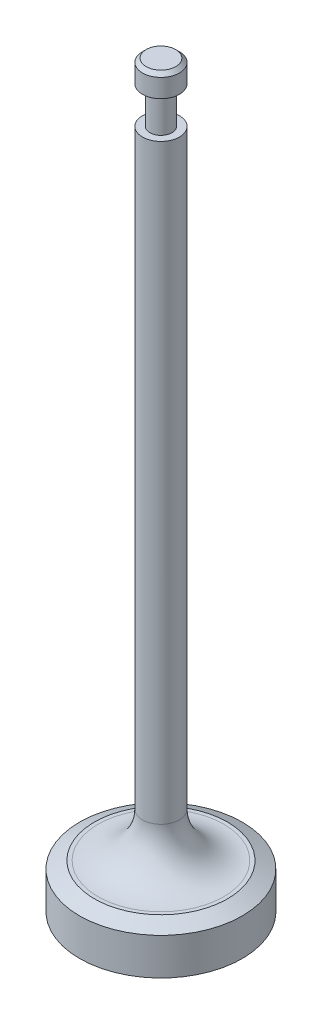
ISO-10303-21;
HEADER;
FILE_DESCRIPTION(('STEP AP214'),'2;1');
FILE_NAME('part.step','',(''),(''),'','','');
FILE_SCHEMA(('AUTOMOTIVE_DESIGN { 1 0 10303 214 1 1 1 1 }'));
ENDSEC;
DATA;
#1=APPLICATION_CONTEXT('core data for automotive mechanical design processes');
#2=APPLICATION_PROTOCOL_DEFINITION('international standard','automotive_design',2000,#1);
#3=PRODUCT_CONTEXT('',#1,'mechanical');
#4=PRODUCT('Part','Part','',(#3));
#5=PRODUCT_RELATED_PRODUCT_CATEGORY('part','',(#4));
#6=PRODUCT_DEFINITION_FORMATION('','',#4);
#7=PRODUCT_DEFINITION_CONTEXT('part definition',#1,'design');
#8=PRODUCT_DEFINITION('design','',#6,#7);
#9=PRODUCT_DEFINITION_SHAPE('','',#8);
#10=(LENGTH_UNIT() NAMED_UNIT(*) SI_UNIT(.MILLI.,.METRE.));
#11=(NAMED_UNIT(*) PLANE_ANGLE_UNIT() SI_UNIT($,.RADIAN.));
#12=(NAMED_UNIT(*) SI_UNIT($,.STERADIAN.) SOLID_ANGLE_UNIT());
#13=UNCERTAINTY_MEASURE_WITH_UNIT(LENGTH_MEASURE(1.E-05),#10,'distance_accuracy_value','');
#14=(GEOMETRIC_REPRESENTATION_CONTEXT(3) GLOBAL_UNCERTAINTY_ASSIGNED_CONTEXT((#13)) GLOBAL_UNIT_ASSIGNED_CONTEXT((#10,
#11,#12)) REPRESENTATION_CONTEXT('',''));
#15=CARTESIAN_POINT('',(0.,0.,0.));
#16=DIRECTION('',(0.,0.,1.));
#17=DIRECTION('',(1.,0.,0.));
#18=AXIS2_PLACEMENT_3D('',#15,#16,#17);
#19=CARTESIAN_POINT('',(0.,0.,-2.50000000000002));
#20=DIRECTION('',(0.,-1.,0.));
#21=DIRECTION('',(0.,0.,-1.));
#22=AXIS2_PLACEMENT_3D('',#19,#20,#21);
#23=PLANE('',#22);
#24=CARTESIAN_POINT('',(0.,0.,0.));
#25=DIRECTION('',(0.,-1.,0.));
#26=DIRECTION('',(0.,0.,-1.));
#27=AXIS2_PLACEMENT_3D('',#24,#25,#26);
#28=CIRCLE('',#27,2.00000000000002);
#29=CARTESIAN_POINT('',(0.,0.,-2.00000000000002));
#30=VERTEX_POINT('',#29);
#31=EDGE_CURVE('E45',#30,#30,#28,.F.);
#32=ORIENTED_EDGE('',*,*,#31,.T.);
#33=EDGE_LOOP('',(#32));
#34=FACE_BOUND('',#33,.T.);
#35=ADVANCED_FACE('F37',(#34),#23,.F.);
#36=CARTESIAN_POINT('',(0.,-100.,0.));
#37=DIRECTION('',(0.,1.,0.));
#38=DIRECTION('',(0.,0.,1.));
#39=AXIS2_PLACEMENT_3D('',#36,#37,#38);
#40=PLANE('',#39);
#41=CARTESIAN_POINT('',(0.,-100.,0.));
#42=DIRECTION('',(0.,1.,0.));
#43=DIRECTION('',(0.,0.,1.));
#44=AXIS2_PLACEMENT_3D('',#41,#42,#43);
#45=CIRCLE('',#44,11.);
#46=CARTESIAN_POINT('',(0.,-100.,11.));
#47=VERTEX_POINT('',#46);
#48=EDGE_CURVE('E64',#47,#47,#45,.T.);
#49=ORIENTED_EDGE('',*,*,#48,.F.);
#50=EDGE_LOOP('',(#49));
#51=FACE_BOUND('',#50,.T.);
#52=ADVANCED_FACE('F112',(#51),#40,.F.);
#53=CARTESIAN_POINT('',(0.,0.,0.));
#54=DIRECTION('',(0.,1.,0.));
#55=DIRECTION('',(0.,0.,1.));
#56=AXIS2_PLACEMENT_3D('',#53,#54,#55);
#57=CYLINDRICAL_SURFACE('',#56,11.);
#58=CARTESIAN_POINT('',(0.,-95.,0.));
#59=DIRECTION('',(0.,-1.,0.));
#60=DIRECTION('',(0.,0.,-1.));
#61=AXIS2_PLACEMENT_3D('',#58,#59,#60);
#62=CIRCLE('',#61,11.);
#63=CARTESIAN_POINT('',(0.,-95.,-11.));
#64=VERTEX_POINT('',#63);
#65=EDGE_CURVE('E49',#64,#64,#62,.T.);
#66=ORIENTED_EDGE('',*,*,#65,.T.);
#67=EDGE_LOOP('',(#66));
#68=FACE_BOUND('',#67,.T.);
#69=ORIENTED_EDGE('',*,*,#48,.T.);
#70=EDGE_LOOP('',(#69));
#71=FACE_BOUND('',#70,.T.);
#72=ADVANCED_FACE('F108',(#68,#71),#57,.T.);
#73=CARTESIAN_POINT('',(0.,-94.,-11.));
#74=DIRECTION('',(0.,-1.,0.));
#75=DIRECTION('',(0.,0.,-1.));
#76=AXIS2_PLACEMENT_3D('',#73,#74,#75);
#77=PLANE('',#76);
#78=CARTESIAN_POINT('',(0.,-94.,0.));
#79=DIRECTION('',(0.,-1.,0.));
#80=DIRECTION('',(0.,0.,-1.));
#81=AXIS2_PLACEMENT_3D('',#78,#79,#80);
#82=CIRCLE('',#81,9.);
#83=CARTESIAN_POINT('',(0.,-94.,-9.00000000000001));
#84=VERTEX_POINT('',#83);
#85=EDGE_CURVE('E53',#84,#84,#82,.F.);
#86=ORIENTED_EDGE('',*,*,#85,.T.);
#87=EDGE_LOOP('',(#86));
#88=FACE_BOUND('',#87,.T.);
#89=CARTESIAN_POINT('',(0.,-94.,0.));
#90=DIRECTION('',(0.,-1.,0.));
#91=DIRECTION('',(0.,0.,-1.));
#92=AXIS2_PLACEMENT_3D('',#89,#90,#91);
#93=CIRCLE('',#92,8.5);
#94=CARTESIAN_POINT('',(0.,-94.,-8.50000000000002));
#95=VERTEX_POINT('',#94);
#96=EDGE_CURVE('E58',#95,#95,#93,.T.);
#97=ORIENTED_EDGE('',*,*,#96,.T.);
#98=EDGE_LOOP('',(#97));
#99=FACE_BOUND('',#98,.T.);
#100=ADVANCED_FACE('F102',(#88,#99),#77,.F.);
#101=CARTESIAN_POINT('',(0.,0.,0.));
#102=DIRECTION('',(0.,1.,0.));
#103=DIRECTION('',(0.,0.,1.));
#104=AXIS2_PLACEMENT_3D('',#101,#102,#103);
#105=CYLINDRICAL_SURFACE('',#104,2.5);
#106=CARTESIAN_POINT('',(0.,-88.,0.));
#107=DIRECTION('',(0.,-1.,0.));
#108=DIRECTION('',(0.,0.,-1.));
#109=AXIS2_PLACEMENT_3D('',#106,#107,#108);
#110=CIRCLE('',#109,2.5);
#111=CARTESIAN_POINT('',(0.,-88.,-2.50000000000001));
#112=VERTEX_POINT('',#111);
#113=EDGE_CURVE('E61',#112,#112,#110,.F.);
#114=ORIENTED_EDGE('',*,*,#113,.T.);
#115=EDGE_LOOP('',(#114));
#116=FACE_BOUND('',#115,.T.);
#117=CARTESIAN_POINT('',(0.,-8.,0.));
#118=DIRECTION('',(0.,1.,0.));
#119=DIRECTION('',(0.,0.,1.));
#120=AXIS2_PLACEMENT_3D('',#117,#118,#119);
#121=CIRCLE('',#120,2.50000000000001);
#122=CARTESIAN_POINT('',(0.,-8.,2.50000000000001));
#123=VERTEX_POINT('',#122);
#124=EDGE_CURVE('E67',#123,#123,#121,.T.);
#125=ORIENTED_EDGE('',*,*,#124,.F.);
#126=EDGE_LOOP('',(#125));
#127=FACE_BOUND('',#126,.T.);
#128=ADVANCED_FACE('F97',(#116,#127),#105,.T.);
#129=CARTESIAN_POINT('',(0.,-8.,-2.50000000000001));
#130=DIRECTION('',(0.,-1.,0.));
#131=DIRECTION('',(0.,0.,-1.));
#132=AXIS2_PLACEMENT_3D('',#129,#130,#131);
#133=PLANE('',#132);
#134=CARTESIAN_POINT('',(0.,-8.,0.));
#135=DIRECTION('',(0.,1.,0.));
#136=DIRECTION('',(0.,0.,1.));
#137=AXIS2_PLACEMENT_3D('',#134,#135,#136);
#138=CIRCLE('',#137,1.50000000000002);
#139=CARTESIAN_POINT('',(0.,-8.,1.50000000000002));
#140=VERTEX_POINT('',#139);
#141=EDGE_CURVE('E70',#140,#140,#138,.T.);
#142=ORIENTED_EDGE('',*,*,#141,.F.);
#143=EDGE_LOOP('',(#142));
#144=FACE_BOUND('',#143,.T.);
#145=ORIENTED_EDGE('',*,*,#124,.T.);
#146=EDGE_LOOP('',(#145));
#147=FACE_BOUND('',#146,.T.);
#148=ADVANCED_FACE('F91',(#144,#147),#133,.F.);
#149=CARTESIAN_POINT('',(0.,0.,0.));
#150=DIRECTION('',(0.,1.,0.));
#151=DIRECTION('',(0.,0.,1.));
#152=AXIS2_PLACEMENT_3D('',#149,#150,#151);
#153=CYLINDRICAL_SURFACE('',#152,1.50000000000002);
#154=CARTESIAN_POINT('',(0.,-3.,0.));
#155=DIRECTION('',(0.,1.,0.));
#156=DIRECTION('',(0.,0.,1.));
#157=AXIS2_PLACEMENT_3D('',#154,#155,#156);
#158=CIRCLE('',#157,1.50000000000002);
#159=CARTESIAN_POINT('',(0.,-3.,1.50000000000002));
#160=VERTEX_POINT('',#159);
#161=EDGE_CURVE('E73',#160,#160,#158,.T.);
#162=ORIENTED_EDGE('',*,*,#161,.F.);
#163=EDGE_LOOP('',(#162));
#164=FACE_BOUND('',#163,.T.);
#165=ORIENTED_EDGE('',*,*,#141,.T.);
#166=EDGE_LOOP('',(#165));
#167=FACE_BOUND('',#166,.T.);
#168=ADVANCED_FACE('F85',(#164,#167),#153,.T.);
#169=CARTESIAN_POINT('',(0.,-3.,-1.50000000000002));
#170=DIRECTION('',(0.,1.,0.));
#171=DIRECTION('',(0.,0.,1.));
#172=AXIS2_PLACEMENT_3D('',#169,#170,#171);
#173=PLANE('',#172);
#174=CARTESIAN_POINT('',(0.,-3.,0.));
#175=DIRECTION('',(0.,1.,0.));
#176=DIRECTION('',(0.,0.,1.));
#177=AXIS2_PLACEMENT_3D('',#174,#175,#176);
#178=CIRCLE('',#177,2.50000000000002);
#179=CARTESIAN_POINT('',(0.,-3.,2.50000000000002));
#180=VERTEX_POINT('',#179);
#181=EDGE_CURVE('E76',#180,#180,#178,.T.);
#182=ORIENTED_EDGE('',*,*,#181,.F.);
#183=EDGE_LOOP('',(#182));
#184=FACE_BOUND('',#183,.T.);
#185=ORIENTED_EDGE('',*,*,#161,.T.);
#186=EDGE_LOOP('',(#185));
#187=FACE_BOUND('',#186,.T.);
#188=ADVANCED_FACE('F82',(#184,#187),#173,.F.);
#189=CARTESIAN_POINT('',(0.,0.,0.));
#190=DIRECTION('',(0.,1.,0.));
#191=DIRECTION('',(0.,0.,1.));
#192=AXIS2_PLACEMENT_3D('',#189,#190,#191);
#193=CYLINDRICAL_SURFACE('',#192,2.50000000000002);
#194=CARTESIAN_POINT('',(0.,-0.500000000000002,0.));
#195=DIRECTION('',(0.,-1.,0.));
#196=DIRECTION('',(0.,0.,-1.));
#197=AXIS2_PLACEMENT_3D('',#194,#195,#196);
#198=CIRCLE('',#197,2.50000000000002);
#199=CARTESIAN_POINT('',(0.,-0.500000000000002,-2.50000000000002));
#200=VERTEX_POINT('',#199);
#201=EDGE_CURVE('E10',#200,#200,#198,.T.);
#202=ORIENTED_EDGE('',*,*,#201,.T.);
#203=EDGE_LOOP('',(#202));
#204=FACE_BOUND('',#203,.T.);
#205=ORIENTED_EDGE('',*,*,#181,.T.);
#206=EDGE_LOOP('',(#205));
#207=FACE_BOUND('',#206,.T.);
#208=ADVANCED_FACE('F80',(#204,#207),#193,.T.);
#209=CARTESIAN_POINT('',(0.,-88.,0.));
#210=DIRECTION('',(0.,-1.,0.));
#211=DIRECTION('',(0.,0.,-1.));
#212=AXIS2_PLACEMENT_3D('',#209,#210,#211);
#213=TOROIDAL_SURFACE('',#212,8.5,6.);
#214=ORIENTED_EDGE('',*,*,#96,.F.);
#215=EDGE_LOOP('',(#214));
#216=FACE_BOUND('',#215,.T.);
#217=ORIENTED_EDGE('',*,*,#113,.F.);
#218=EDGE_LOOP('',(#217));
#219=FACE_BOUND('',#218,.T.);
#220=ADVANCED_FACE('F121',(#216,#219),#213,.F.);
#221=CARTESIAN_POINT('',(0.,-94.,0.));
#222=DIRECTION('',(0.,-1.,0.));
#223=DIRECTION('',(0.,0.,-1.));
#224=AXIS2_PLACEMENT_3D('',#221,#222,#223);
#225=CONICAL_SURFACE('',#224,8.99999999999999,1.1071487177941);
#226=ORIENTED_EDGE('',*,*,#65,.F.);
#227=EDGE_LOOP('',(#226));
#228=FACE_BOUND('',#227,.T.);
#229=ORIENTED_EDGE('',*,*,#85,.F.);
#230=EDGE_LOOP('',(#229));
#231=FACE_BOUND('',#230,.T.);
#232=ADVANCED_FACE('F123',(#228,#231),#225,.T.);
#233=CARTESIAN_POINT('',(0.,0.,0.));
#234=DIRECTION('',(0.,-1.,0.));
#235=DIRECTION('',(0.,0.,-1.));
#236=AXIS2_PLACEMENT_3D('',#233,#234,#235);
#237=CONICAL_SURFACE('',#236,2.00000000000002,0.785398163397453);
#238=ORIENTED_EDGE('',*,*,#201,.F.);
#239=EDGE_LOOP('',(#238));
#240=FACE_BOUND('',#239,.T.);
#241=ORIENTED_EDGE('',*,*,#31,.F.);
#242=EDGE_LOOP('',(#241));
#243=FACE_BOUND('',#242,.T.);
#244=ADVANCED_FACE('F40',(#240,#243),#237,.T.);
#245=CLOSED_SHELL('',(#35,#52,#72,#100,#128,#148,#168,#188,#208,#220,#232,#244));
#246=MANIFOLD_SOLID_BREP('B2',#245);
#247=ADVANCED_BREP_SHAPE_REPRESENTATION('',(#18,#246),#14);
#248=SHAPE_DEFINITION_REPRESENTATION(#9,#247);
ENDSEC;
END-ISO-10303-21;
